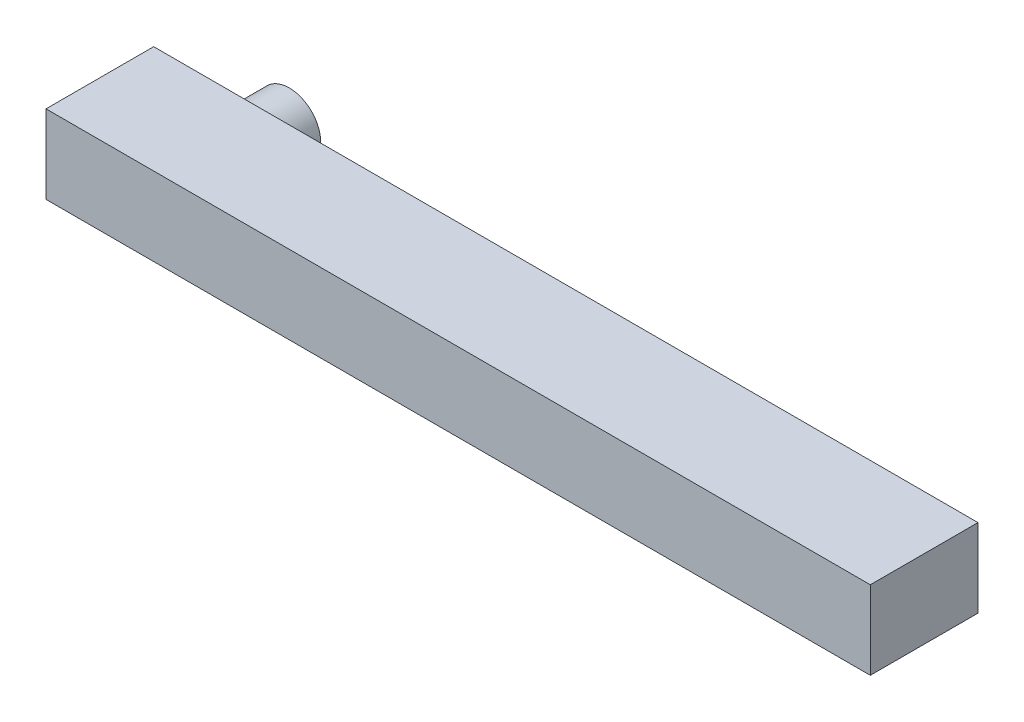
ISO-10303-21;
HEADER;
FILE_DESCRIPTION(('STEP AP214'),'2;1');
FILE_NAME('part.step','',(''),(''),'','','');
FILE_SCHEMA(('AUTOMOTIVE_DESIGN { 1 0 10303 214 1 1 1 1 }'));
ENDSEC;
DATA;
#1=APPLICATION_CONTEXT('core data for automotive mechanical design processes');
#2=APPLICATION_PROTOCOL_DEFINITION('international standard','automotive_design',2000,#1);
#3=PRODUCT_CONTEXT('',#1,'mechanical');
#4=PRODUCT('Part','Part','',(#3));
#5=PRODUCT_RELATED_PRODUCT_CATEGORY('part','',(#4));
#6=PRODUCT_DEFINITION_FORMATION('','',#4);
#7=PRODUCT_DEFINITION_CONTEXT('part definition',#1,'design');
#8=PRODUCT_DEFINITION('design','',#6,#7);
#9=PRODUCT_DEFINITION_SHAPE('','',#8);
#10=(LENGTH_UNIT() NAMED_UNIT(*) SI_UNIT(.MILLI.,.METRE.));
#11=(NAMED_UNIT(*) PLANE_ANGLE_UNIT() SI_UNIT($,.RADIAN.));
#12=(NAMED_UNIT(*) SI_UNIT($,.STERADIAN.) SOLID_ANGLE_UNIT());
#13=UNCERTAINTY_MEASURE_WITH_UNIT(LENGTH_MEASURE(1.E-05),#10,'distance_accuracy_value','');
#14=(GEOMETRIC_REPRESENTATION_CONTEXT(3) GLOBAL_UNCERTAINTY_ASSIGNED_CONTEXT((#13)) GLOBAL_UNIT_ASSIGNED_CONTEXT((#10,
#11,#12)) REPRESENTATION_CONTEXT('',''));
#15=CARTESIAN_POINT('',(0.,0.,0.));
#16=DIRECTION('',(0.,0.,1.));
#17=DIRECTION('',(1.,0.,0.));
#18=AXIS2_PLACEMENT_3D('',#15,#16,#17);
#19=CARTESIAN_POINT('',(-31.,5.9,-8.1));
#20=DIRECTION('',(-1.,0.,0.));
#21=DIRECTION('',(0.,0.,1.));
#22=AXIS2_PLACEMENT_3D('',#19,#20,#21);
#23=PLANE('',#22);
#24=DIRECTION('',(0.,-1.,0.));
#25=VECTOR('',#24,1.);
#26=CARTESIAN_POINT('',(-31.,5.9,0.));
#27=LINE('',#26,#25);
#28=CARTESIAN_POINT('',(-31.,5.9,0.));
#29=VERTEX_POINT('',#28);
#30=CARTESIAN_POINT('',(-31.,0.,0.));
#31=VERTEX_POINT('',#30);
#32=EDGE_CURVE('E107',#29,#31,#27,.T.);
#33=ORIENTED_EDGE('',*,*,#32,.F.);
#34=DIRECTION('',(0.,0.,1.));
#35=VECTOR('',#34,1.);
#36=CARTESIAN_POINT('',(-31.,5.9,-8.1));
#37=LINE('',#36,#35);
#38=CARTESIAN_POINT('',(-31.,5.9,-8.1));
#39=VERTEX_POINT('',#38);
#40=EDGE_CURVE('E48',#39,#29,#37,.T.);
#41=ORIENTED_EDGE('',*,*,#40,.F.);
#42=DIRECTION('',(0.,-1.,0.));
#43=VECTOR('',#42,1.);
#44=CARTESIAN_POINT('',(-31.,5.9,-8.1));
#45=LINE('',#44,#43);
#46=CARTESIAN_POINT('',(-31.,0.,-8.1));
#47=VERTEX_POINT('',#46);
#48=EDGE_CURVE('E100',#39,#47,#45,.T.);
#49=ORIENTED_EDGE('',*,*,#48,.T.);
#50=DIRECTION('',(0.,0.,1.));
#51=VECTOR('',#50,1.);
#52=CARTESIAN_POINT('',(-31.,0.,-8.1));
#53=LINE('',#52,#51);
#54=EDGE_CURVE('E83',#47,#31,#53,.T.);
#55=ORIENTED_EDGE('',*,*,#54,.T.);
#56=EDGE_LOOP('',(#33,#41,#49,#55));
#57=FACE_BOUND('',#56,.T.);
#58=ADVANCED_FACE('F40',(#57),#23,.T.);
#59=CARTESIAN_POINT('',(31.,5.90000000000001,-8.1));
#60=DIRECTION('',(0.,1.,0.));
#61=DIRECTION('',(-1.,0.,0.));
#62=AXIS2_PLACEMENT_3D('',#59,#60,#61);
#63=PLANE('',#62);
#64=DIRECTION('',(-1.,0.,0.));
#65=VECTOR('',#64,1.);
#66=CARTESIAN_POINT('',(31.,5.90000000000001,0.));
#67=LINE('',#66,#65);
#68=CARTESIAN_POINT('',(31.,5.90000000000001,0.));
#69=VERTEX_POINT('',#68);
#70=EDGE_CURVE('E102',#69,#29,#67,.T.);
#71=ORIENTED_EDGE('',*,*,#70,.F.);
#72=DIRECTION('',(0.,0.,1.));
#73=VECTOR('',#72,1.);
#74=CARTESIAN_POINT('',(31.,5.90000000000001,-8.1));
#75=LINE('',#74,#73);
#76=CARTESIAN_POINT('',(31.,5.90000000000001,-8.1));
#77=VERTEX_POINT('',#76);
#78=EDGE_CURVE('E72',#77,#69,#75,.T.);
#79=ORIENTED_EDGE('',*,*,#78,.F.);
#80=DIRECTION('',(-1.,0.,0.));
#81=VECTOR('',#80,1.);
#82=CARTESIAN_POINT('',(31.,5.90000000000001,-8.1));
#83=LINE('',#82,#81);
#84=EDGE_CURVE('E97',#77,#39,#83,.T.);
#85=ORIENTED_EDGE('',*,*,#84,.T.);
#86=ORIENTED_EDGE('',*,*,#40,.T.);
#87=EDGE_LOOP('',(#71,#79,#85,#86));
#88=FACE_BOUND('',#87,.T.);
#89=ADVANCED_FACE('F119',(#88),#63,.T.);
#90=CARTESIAN_POINT('',(31.,0.,-8.1));
#91=DIRECTION('',(1.,0.,0.));
#92=DIRECTION('',(0.,0.,-1.));
#93=AXIS2_PLACEMENT_3D('',#90,#91,#92);
#94=PLANE('',#93);
#95=DIRECTION('',(0.,1.,0.));
#96=VECTOR('',#95,1.);
#97=CARTESIAN_POINT('',(31.,0.,0.));
#98=LINE('',#97,#96);
#99=CARTESIAN_POINT('',(31.,0.,0.));
#100=VERTEX_POINT('',#99);
#101=EDGE_CURVE('E91',#100,#69,#98,.T.);
#102=ORIENTED_EDGE('',*,*,#101,.F.);
#103=DIRECTION('',(0.,0.,1.));
#104=VECTOR('',#103,1.);
#105=CARTESIAN_POINT('',(31.,0.,-8.1));
#106=LINE('',#105,#104);
#107=CARTESIAN_POINT('',(31.,0.,-8.1));
#108=VERTEX_POINT('',#107);
#109=EDGE_CURVE('E86',#108,#100,#106,.T.);
#110=ORIENTED_EDGE('',*,*,#109,.F.);
#111=DIRECTION('',(0.,1.,0.));
#112=VECTOR('',#111,1.);
#113=CARTESIAN_POINT('',(31.,0.,-8.1));
#114=LINE('',#113,#112);
#115=EDGE_CURVE('E89',#108,#77,#114,.T.);
#116=ORIENTED_EDGE('',*,*,#115,.T.);
#117=ORIENTED_EDGE('',*,*,#78,.T.);
#118=EDGE_LOOP('',(#102,#110,#116,#117));
#119=FACE_BOUND('',#118,.T.);
#120=ADVANCED_FACE('F88',(#119),#94,.T.);
#121=CARTESIAN_POINT('',(-31.,0.,-8.1));
#122=DIRECTION('',(0.,-1.,0.));
#123=DIRECTION('',(1.,0.,0.));
#124=AXIS2_PLACEMENT_3D('',#121,#122,#123);
#125=PLANE('',#124);
#126=DIRECTION('',(1.,0.,0.));
#127=VECTOR('',#126,1.);
#128=CARTESIAN_POINT('',(-31.,0.,0.));
#129=LINE('',#128,#127);
#130=EDGE_CURVE('E110',#31,#100,#129,.T.);
#131=ORIENTED_EDGE('',*,*,#130,.F.);
#132=ORIENTED_EDGE('',*,*,#54,.F.);
#133=DIRECTION('',(1.,0.,0.));
#134=VECTOR('',#133,1.);
#135=CARTESIAN_POINT('',(-31.,0.,-8.1));
#136=LINE('',#135,#134);
#137=EDGE_CURVE('E96',#47,#108,#136,.T.);
#138=ORIENTED_EDGE('',*,*,#137,.T.);
#139=ORIENTED_EDGE('',*,*,#109,.T.);
#140=EDGE_LOOP('',(#131,#132,#138,#139));
#141=FACE_BOUND('',#140,.T.);
#142=ADVANCED_FACE('F99',(#141),#125,.T.);
#143=CARTESIAN_POINT('',(0.,0.,-8.1));
#144=DIRECTION('',(0.,0.,1.));
#145=DIRECTION('',(1.,0.,0.));
#146=AXIS2_PLACEMENT_3D('',#143,#144,#145);
#147=PLANE('',#146);
#148=CARTESIAN_POINT('',(-23.8,2.95,-8.1));
#149=DIRECTION('',(0.,0.,1.));
#150=DIRECTION('',(1.,0.,0.));
#151=AXIS2_PLACEMENT_3D('',#148,#149,#150);
#152=CIRCLE('',#151,2.365);
#153=CARTESIAN_POINT('',(-21.435,2.95,-8.1));
#154=VERTEX_POINT('',#153);
#155=EDGE_CURVE('E11',#154,#154,#152,.F.);
#156=ORIENTED_EDGE('',*,*,#155,.F.);
#157=EDGE_LOOP('',(#156));
#158=FACE_BOUND('',#157,.T.);
#159=ORIENTED_EDGE('',*,*,#48,.F.);
#160=ORIENTED_EDGE('',*,*,#84,.F.);
#161=ORIENTED_EDGE('',*,*,#115,.F.);
#162=ORIENTED_EDGE('',*,*,#137,.F.);
#163=EDGE_LOOP('',(#159,#160,#161,#162));
#164=FACE_BOUND('',#163,.T.);
#165=ADVANCED_FACE('F95',(#158,#164),#147,.F.);
#166=CARTESIAN_POINT('',(0.,0.,0.));
#167=DIRECTION('',(0.,0.,1.));
#168=DIRECTION('',(1.,0.,0.));
#169=AXIS2_PLACEMENT_3D('',#166,#167,#168);
#170=PLANE('',#169);
#171=ORIENTED_EDGE('',*,*,#32,.T.);
#172=ORIENTED_EDGE('',*,*,#130,.T.);
#173=ORIENTED_EDGE('',*,*,#101,.T.);
#174=ORIENTED_EDGE('',*,*,#70,.T.);
#175=EDGE_LOOP('',(#171,#172,#173,#174));
#176=FACE_BOUND('',#175,.T.);
#177=ADVANCED_FACE('F118',(#176),#170,.T.);
#178=CARTESIAN_POINT('',(-23.8,2.95,-11.1));
#179=DIRECTION('',(0.,0.,1.));
#180=DIRECTION('',(1.,0.,0.));
#181=AXIS2_PLACEMENT_3D('',#178,#179,#180);
#182=CYLINDRICAL_SURFACE('',#181,2.365);
#183=CARTESIAN_POINT('',(-23.8,2.95,-11.1));
#184=DIRECTION('',(0.,0.,-1.));
#185=DIRECTION('',(-1.,0.,0.));
#186=AXIS2_PLACEMENT_3D('',#183,#184,#185);
#187=CIRCLE('',#186,2.365);
#188=CARTESIAN_POINT('',(-26.165,2.95,-11.1));
#189=VERTEX_POINT('',#188);
#190=EDGE_CURVE('E111',#189,#189,#187,.T.);
#191=ORIENTED_EDGE('',*,*,#190,.F.);
#192=EDGE_LOOP('',(#191));
#193=FACE_BOUND('',#192,.T.);
#194=ORIENTED_EDGE('',*,*,#155,.T.);
#195=EDGE_LOOP('',(#194));
#196=FACE_BOUND('',#195,.T.);
#197=ADVANCED_FACE('F137',(#193,#196),#182,.T.);
#198=CARTESIAN_POINT('',(-23.8,2.95,-11.1));
#199=DIRECTION('',(0.,0.,-1.));
#200=DIRECTION('',(-1.,0.,0.));
#201=AXIS2_PLACEMENT_3D('',#198,#199,#200);
#202=PLANE('',#201);
#203=ORIENTED_EDGE('',*,*,#190,.T.);
#204=EDGE_LOOP('',(#203));
#205=FACE_BOUND('',#204,.T.);
#206=ADVANCED_FACE('F142',(#205),#202,.T.);
#207=CLOSED_SHELL('',(#58,#89,#120,#142,#165,#177,#197,#206));
#208=MANIFOLD_SOLID_BREP('B2',#207);
#209=ADVANCED_BREP_SHAPE_REPRESENTATION('',(#18,#208),#14);
#210=SHAPE_DEFINITION_REPRESENTATION(#9,#209);
ENDSEC;
END-ISO-10303-21;
